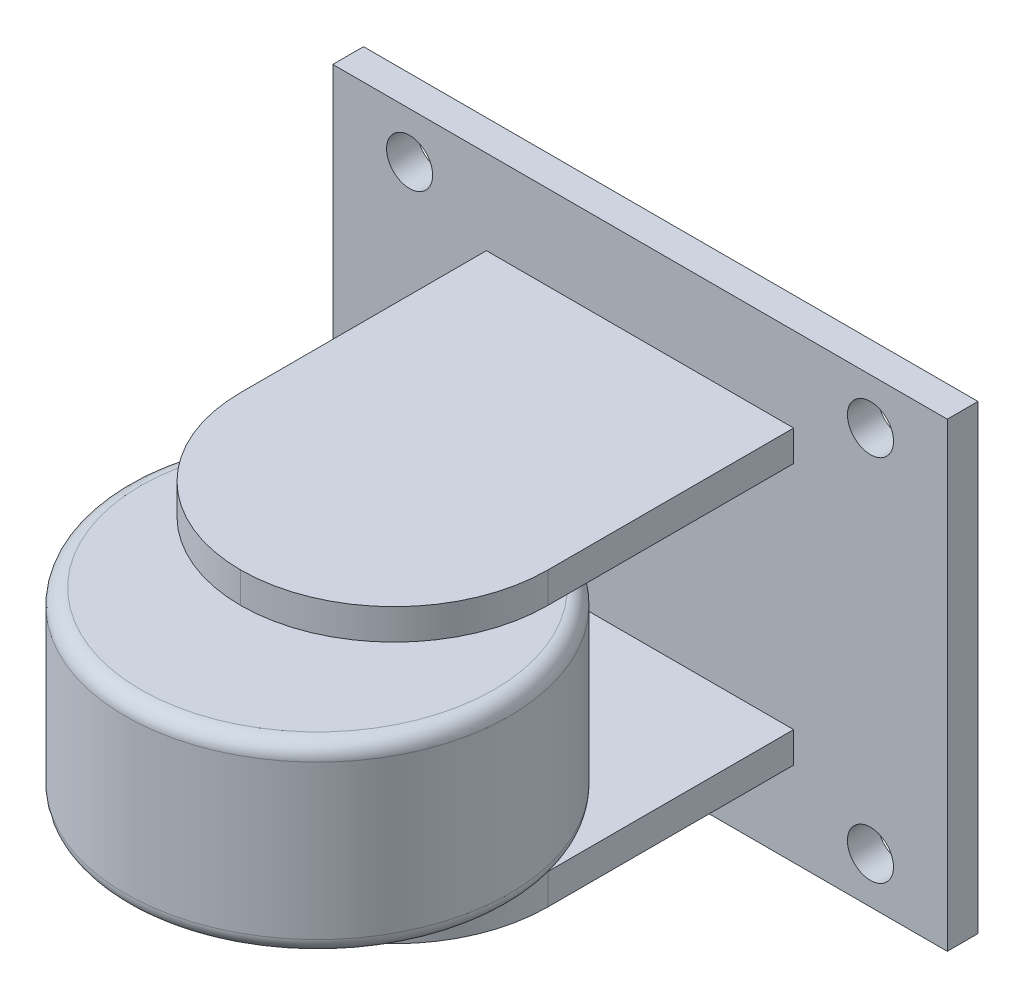
ISO-10303-21;
HEADER;
FILE_DESCRIPTION(('STEP AP214'),'2;1');
FILE_NAME('part.step','',(''),(''),'','','');
FILE_SCHEMA(('AUTOMOTIVE_DESIGN { 1 0 10303 214 1 1 1 1 }'));
ENDSEC;
DATA;
#1=APPLICATION_CONTEXT('core data for automotive mechanical design processes');
#2=APPLICATION_PROTOCOL_DEFINITION('international standard','automotive_design',2000,#1);
#3=PRODUCT_CONTEXT('',#1,'mechanical');
#4=PRODUCT('Part','Part','',(#3));
#5=PRODUCT_RELATED_PRODUCT_CATEGORY('part','',(#4));
#6=PRODUCT_DEFINITION_FORMATION('','',#4);
#7=PRODUCT_DEFINITION_CONTEXT('part definition',#1,'design');
#8=PRODUCT_DEFINITION('design','',#6,#7);
#9=PRODUCT_DEFINITION_SHAPE('','',#8);
#10=(LENGTH_UNIT() NAMED_UNIT(*) SI_UNIT(.MILLI.,.METRE.));
#11=(NAMED_UNIT(*) PLANE_ANGLE_UNIT() SI_UNIT($,.RADIAN.));
#12=(NAMED_UNIT(*) SI_UNIT($,.STERADIAN.) SOLID_ANGLE_UNIT());
#13=UNCERTAINTY_MEASURE_WITH_UNIT(LENGTH_MEASURE(1.E-05),#10,'distance_accuracy_value','');
#14=(GEOMETRIC_REPRESENTATION_CONTEXT(3) GLOBAL_UNCERTAINTY_ASSIGNED_CONTEXT((#13)) GLOBAL_UNIT_ASSIGNED_CONTEXT((#10,
#11,#12)) REPRESENTATION_CONTEXT('',''));
#15=CARTESIAN_POINT('',(0.,0.,0.));
#16=DIRECTION('',(0.,0.,1.));
#17=DIRECTION('',(1.,0.,0.));
#18=AXIS2_PLACEMENT_3D('',#15,#16,#17);
#19=CARTESIAN_POINT('',(0.,-16.5710678118655,23.));
#20=DIRECTION('',(0.,1.,0.));
#21=DIRECTION('',(0.,0.,1.));
#22=AXIS2_PLACEMENT_3D('',#19,#20,#21);
#23=CYLINDRICAL_SURFACE('',#22,2.5);
#24=CARTESIAN_POINT('',(0.,7.5,23.));
#25=DIRECTION('',(0.,1.,0.));
#26=DIRECTION('',(0.,0.,1.));
#27=AXIS2_PLACEMENT_3D('',#24,#25,#26);
#28=CIRCLE('',#27,2.5);
#29=CARTESIAN_POINT('',(0.,7.5,25.5));
#30=VERTEX_POINT('',#29);
#31=EDGE_CURVE('E242',#30,#30,#28,.T.);
#32=ORIENTED_EDGE('',*,*,#31,.F.);
#33=EDGE_LOOP('',(#32));
#34=FACE_BOUND('',#33,.T.);
#35=CARTESIAN_POINT('',(0.,6.,23.));
#36=DIRECTION('',(0.,-1.,0.));
#37=DIRECTION('',(0.,0.,-1.));
#38=AXIS2_PLACEMENT_3D('',#35,#36,#37);
#39=CIRCLE('',#38,2.5);
#40=CARTESIAN_POINT('',(0.,6.,20.5));
#41=VERTEX_POINT('',#40);
#42=EDGE_CURVE('E245',#41,#41,#39,.F.);
#43=ORIENTED_EDGE('',*,*,#42,.T.);
#44=EDGE_LOOP('',(#43));
#45=FACE_BOUND('',#44,.T.);
#46=ADVANCED_FACE('F36',(#34,#45),#23,.T.);
#47=CARTESIAN_POINT('',(0.,0.,2.));
#48=DIRECTION('',(0.,0.,-1.));
#49=DIRECTION('',(-1.,0.,0.));
#50=AXIS2_PLACEMENT_3D('',#47,#48,#49);
#51=PLANE('',#50);
#52=DIRECTION('',(0.,-1.,0.));
#53=VECTOR('',#52,1.);
#54=CARTESIAN_POINT('',(-10.,-7.5,2.));
#55=LINE('',#54,#53);
#56=CARTESIAN_POINT('',(-10.,-7.5,2.));
#57=VERTEX_POINT('',#56);
#58=CARTESIAN_POINT('',(-10.,-9.5,2.));
#59=VERTEX_POINT('',#58);
#60=EDGE_CURVE('E167',#57,#59,#55,.T.);
#61=ORIENTED_EDGE('',*,*,#60,.F.);
#62=DIRECTION('',(-1.,0.,0.));
#63=VECTOR('',#62,1.);
#64=CARTESIAN_POINT('',(-10.,-7.5,2.));
#65=LINE('',#64,#63);
#66=CARTESIAN_POINT('',(10.,-7.5,2.));
#67=VERTEX_POINT('',#66);
#68=EDGE_CURVE('E176',#67,#57,#65,.T.);
#69=ORIENTED_EDGE('',*,*,#68,.F.);
#70=DIRECTION('',(0.,1.,0.));
#71=VECTOR('',#70,1.);
#72=CARTESIAN_POINT('',(10.,-7.5,2.));
#73=LINE('',#72,#71);
#74=CARTESIAN_POINT('',(10.,-9.5,2.));
#75=VERTEX_POINT('',#74);
#76=EDGE_CURVE('E173',#75,#67,#73,.T.);
#77=ORIENTED_EDGE('',*,*,#76,.F.);
#78=DIRECTION('',(1.,0.,0.));
#79=VECTOR('',#78,1.);
#80=CARTESIAN_POINT('',(-10.,-9.5,2.));
#81=LINE('',#80,#79);
#82=EDGE_CURVE('E170',#59,#75,#81,.T.);
#83=ORIENTED_EDGE('',*,*,#82,.F.);
#84=EDGE_LOOP('',(#61,#69,#77,#83));
#85=FACE_BOUND('',#84,.T.);
#86=CARTESIAN_POINT('',(-15.,-12.,2.));
#87=DIRECTION('',(0.,0.,1.));
#88=DIRECTION('',(1.,0.,0.));
#89=AXIS2_PLACEMENT_3D('',#86,#87,#88);
#90=CIRCLE('',#89,1.5);
#91=CARTESIAN_POINT('',(-13.5,-12.,2.));
#92=VERTEX_POINT('',#91);
#93=EDGE_CURVE('E187',#92,#92,#90,.T.);
#94=ORIENTED_EDGE('',*,*,#93,.F.);
#95=EDGE_LOOP('',(#94));
#96=FACE_BOUND('',#95,.T.);
#97=CARTESIAN_POINT('',(15.,-12.,2.));
#98=DIRECTION('',(0.,0.,1.));
#99=DIRECTION('',(1.,0.,0.));
#100=AXIS2_PLACEMENT_3D('',#97,#98,#99);
#101=CIRCLE('',#100,1.5);
#102=CARTESIAN_POINT('',(16.5,-12.,2.));
#103=VERTEX_POINT('',#102);
#104=EDGE_CURVE('E198',#103,#103,#101,.T.);
#105=ORIENTED_EDGE('',*,*,#104,.F.);
#106=EDGE_LOOP('',(#105));
#107=FACE_BOUND('',#106,.T.);
#108=CARTESIAN_POINT('',(15.,12.,2.));
#109=DIRECTION('',(0.,0.,1.));
#110=DIRECTION('',(1.,0.,0.));
#111=AXIS2_PLACEMENT_3D('',#108,#109,#110);
#112=CIRCLE('',#111,1.5);
#113=CARTESIAN_POINT('',(16.5,12.,2.));
#114=VERTEX_POINT('',#113);
#115=EDGE_CURVE('E192',#114,#114,#112,.T.);
#116=ORIENTED_EDGE('',*,*,#115,.F.);
#117=EDGE_LOOP('',(#116));
#118=FACE_BOUND('',#117,.T.);
#119=CARTESIAN_POINT('',(-15.,12.,2.));
#120=DIRECTION('',(0.,0.,1.));
#121=DIRECTION('',(1.,0.,0.));
#122=AXIS2_PLACEMENT_3D('',#119,#120,#121);
#123=CIRCLE('',#122,1.5);
#124=CARTESIAN_POINT('',(-13.5,12.,2.));
#125=VERTEX_POINT('',#124);
#126=EDGE_CURVE('E191',#125,#125,#123,.T.);
#127=ORIENTED_EDGE('',*,*,#126,.F.);
#128=EDGE_LOOP('',(#127));
#129=FACE_BOUND('',#128,.T.);
#130=DIRECTION('',(0.,1.,0.));
#131=VECTOR('',#130,1.);
#132=CARTESIAN_POINT('',(20.,-15.,2.));
#133=LINE('',#132,#131);
#134=CARTESIAN_POINT('',(20.,-15.,2.));
#135=VERTEX_POINT('',#134);
#136=CARTESIAN_POINT('',(20.,15.,2.));
#137=VERTEX_POINT('',#136);
#138=EDGE_CURVE('E212',#135,#137,#133,.T.);
#139=ORIENTED_EDGE('',*,*,#138,.T.);
#140=DIRECTION('',(-1.,0.,0.));
#141=VECTOR('',#140,1.);
#142=CARTESIAN_POINT('',(-20.,15.,2.));
#143=LINE('',#142,#141);
#144=CARTESIAN_POINT('',(-20.,15.,2.));
#145=VERTEX_POINT('',#144);
#146=EDGE_CURVE('E215',#137,#145,#143,.T.);
#147=ORIENTED_EDGE('',*,*,#146,.T.);
#148=DIRECTION('',(0.,-1.,0.));
#149=VECTOR('',#148,1.);
#150=CARTESIAN_POINT('',(-20.,-15.,2.));
#151=LINE('',#150,#149);
#152=CARTESIAN_POINT('',(-20.,-15.,2.));
#153=VERTEX_POINT('',#152);
#154=EDGE_CURVE('E218',#145,#153,#151,.T.);
#155=ORIENTED_EDGE('',*,*,#154,.T.);
#156=DIRECTION('',(1.,0.,0.));
#157=VECTOR('',#156,1.);
#158=CARTESIAN_POINT('',(-20.,-15.,2.));
#159=LINE('',#158,#157);
#160=EDGE_CURVE('E220',#153,#135,#159,.T.);
#161=ORIENTED_EDGE('',*,*,#160,.T.);
#162=EDGE_LOOP('',(#139,#147,#155,#161));
#163=FACE_BOUND('',#162,.T.);
#164=DIRECTION('',(0.,1.,0.));
#165=VECTOR('',#164,1.);
#166=CARTESIAN_POINT('',(10.,7.5,2.));
#167=LINE('',#166,#165);
#168=CARTESIAN_POINT('',(10.,7.5,2.));
#169=VERTEX_POINT('',#168);
#170=CARTESIAN_POINT('',(10.,9.5,2.));
#171=VERTEX_POINT('',#170);
#172=EDGE_CURVE('E139',#169,#171,#167,.T.);
#173=ORIENTED_EDGE('',*,*,#172,.F.);
#174=DIRECTION('',(1.,0.,0.));
#175=VECTOR('',#174,1.);
#176=CARTESIAN_POINT('',(10.,7.5,2.));
#177=LINE('',#176,#175);
#178=CARTESIAN_POINT('',(-10.,7.5,2.));
#179=VERTEX_POINT('',#178);
#180=EDGE_CURVE('E144',#179,#169,#177,.T.);
#181=ORIENTED_EDGE('',*,*,#180,.F.);
#182=DIRECTION('',(0.,-1.,0.));
#183=VECTOR('',#182,1.);
#184=CARTESIAN_POINT('',(-10.,7.5,2.));
#185=LINE('',#184,#183);
#186=CARTESIAN_POINT('',(-10.,9.5,2.));
#187=VERTEX_POINT('',#186);
#188=EDGE_CURVE('E157',#187,#179,#185,.T.);
#189=ORIENTED_EDGE('',*,*,#188,.F.);
#190=DIRECTION('',(-1.,0.,0.));
#191=VECTOR('',#190,1.);
#192=CARTESIAN_POINT('',(10.,9.5,2.));
#193=LINE('',#192,#191);
#194=EDGE_CURVE('E153',#171,#187,#193,.T.);
#195=ORIENTED_EDGE('',*,*,#194,.F.);
#196=EDGE_LOOP('',(#173,#181,#189,#195));
#197=FACE_BOUND('',#196,.T.);
#198=ADVANCED_FACE('F149',(#85,#96,#107,#118,#129,#163,#197),#51,.F.);
#199=CARTESIAN_POINT('',(20.,-15.,2.));
#200=DIRECTION('',(-1.,0.,0.));
#201=DIRECTION('',(0.,0.,1.));
#202=AXIS2_PLACEMENT_3D('',#199,#200,#201);
#203=PLANE('',#202);
#204=DIRECTION('',(0.,1.,0.));
#205=VECTOR('',#204,1.);
#206=CARTESIAN_POINT('',(20.,-15.,0.));
#207=LINE('',#206,#205);
#208=CARTESIAN_POINT('',(20.,-15.,0.));
#209=VERTEX_POINT('',#208);
#210=CARTESIAN_POINT('',(20.,15.,0.));
#211=VERTEX_POINT('',#210);
#212=EDGE_CURVE('E209',#209,#211,#207,.T.);
#213=ORIENTED_EDGE('',*,*,#212,.T.);
#214=DIRECTION('',(0.,0.,-1.));
#215=VECTOR('',#214,1.);
#216=CARTESIAN_POINT('',(20.,15.,2.));
#217=LINE('',#216,#215);
#218=EDGE_CURVE('E238',#137,#211,#217,.T.);
#219=ORIENTED_EDGE('',*,*,#218,.F.);
#220=ORIENTED_EDGE('',*,*,#138,.F.);
#221=DIRECTION('',(0.,0.,-1.));
#222=VECTOR('',#221,1.);
#223=CARTESIAN_POINT('',(20.,-15.,2.));
#224=LINE('',#223,#222);
#225=EDGE_CURVE('E222',#135,#209,#224,.T.);
#226=ORIENTED_EDGE('',*,*,#225,.T.);
#227=EDGE_LOOP('',(#213,#219,#220,#226));
#228=FACE_BOUND('',#227,.T.);
#229=ADVANCED_FACE('F336',(#228),#203,.F.);
#230=CARTESIAN_POINT('',(-20.,15.,2.));
#231=DIRECTION('',(0.,-1.,0.));
#232=DIRECTION('',(0.,0.,-1.));
#233=AXIS2_PLACEMENT_3D('',#230,#231,#232);
#234=PLANE('',#233);
#235=DIRECTION('',(-1.,0.,0.));
#236=VECTOR('',#235,1.);
#237=CARTESIAN_POINT('',(-20.,15.,0.));
#238=LINE('',#237,#236);
#239=CARTESIAN_POINT('',(-20.,15.,0.));
#240=VERTEX_POINT('',#239);
#241=EDGE_CURVE('E225',#211,#240,#238,.T.);
#242=ORIENTED_EDGE('',*,*,#241,.T.);
#243=DIRECTION('',(0.,0.,-1.));
#244=VECTOR('',#243,1.);
#245=CARTESIAN_POINT('',(-20.,15.,2.));
#246=LINE('',#245,#244);
#247=EDGE_CURVE('E235',#145,#240,#246,.T.);
#248=ORIENTED_EDGE('',*,*,#247,.F.);
#249=ORIENTED_EDGE('',*,*,#146,.F.);
#250=ORIENTED_EDGE('',*,*,#218,.T.);
#251=EDGE_LOOP('',(#242,#248,#249,#250));
#252=FACE_BOUND('',#251,.T.);
#253=ADVANCED_FACE('F542',(#252),#234,.F.);
#254=CARTESIAN_POINT('',(-20.,-15.,2.));
#255=DIRECTION('',(1.,0.,0.));
#256=DIRECTION('',(0.,0.,-1.));
#257=AXIS2_PLACEMENT_3D('',#254,#255,#256);
#258=PLANE('',#257);
#259=DIRECTION('',(0.,-1.,0.));
#260=VECTOR('',#259,1.);
#261=CARTESIAN_POINT('',(-20.,-15.,0.));
#262=LINE('',#261,#260);
#263=CARTESIAN_POINT('',(-20.,-15.,0.));
#264=VERTEX_POINT('',#263);
#265=EDGE_CURVE('E227',#240,#264,#262,.T.);
#266=ORIENTED_EDGE('',*,*,#265,.T.);
#267=DIRECTION('',(0.,0.,-1.));
#268=VECTOR('',#267,1.);
#269=CARTESIAN_POINT('',(-20.,-15.,2.));
#270=LINE('',#269,#268);
#271=EDGE_CURVE('E232',#153,#264,#270,.T.);
#272=ORIENTED_EDGE('',*,*,#271,.F.);
#273=ORIENTED_EDGE('',*,*,#154,.F.);
#274=ORIENTED_EDGE('',*,*,#247,.T.);
#275=EDGE_LOOP('',(#266,#272,#273,#274));
#276=FACE_BOUND('',#275,.T.);
#277=ADVANCED_FACE('F532',(#276),#258,.F.);
#278=CARTESIAN_POINT('',(-20.,-15.,2.));
#279=DIRECTION('',(0.,1.,0.));
#280=DIRECTION('',(0.,0.,1.));
#281=AXIS2_PLACEMENT_3D('',#278,#279,#280);
#282=PLANE('',#281);
#283=DIRECTION('',(1.,0.,0.));
#284=VECTOR('',#283,1.);
#285=CARTESIAN_POINT('',(-20.,-15.,0.));
#286=LINE('',#285,#284);
#287=EDGE_CURVE('E216',#264,#209,#286,.T.);
#288=ORIENTED_EDGE('',*,*,#287,.T.);
#289=ORIENTED_EDGE('',*,*,#225,.F.);
#290=ORIENTED_EDGE('',*,*,#160,.F.);
#291=ORIENTED_EDGE('',*,*,#271,.T.);
#292=EDGE_LOOP('',(#288,#289,#290,#291));
#293=FACE_BOUND('',#292,.T.);
#294=ADVANCED_FACE('F522',(#293),#282,.F.);
#295=CARTESIAN_POINT('',(0.,0.,0.));
#296=DIRECTION('',(0.,0.,-1.));
#297=DIRECTION('',(-1.,0.,0.));
#298=AXIS2_PLACEMENT_3D('',#295,#296,#297);
#299=PLANE('',#298);
#300=CARTESIAN_POINT('',(-15.,-12.,0.));
#301=DIRECTION('',(0.,0.,1.));
#302=DIRECTION('',(1.,0.,0.));
#303=AXIS2_PLACEMENT_3D('',#300,#301,#302);
#304=CIRCLE('',#303,1.5);
#305=CARTESIAN_POINT('',(-13.5,-12.,0.));
#306=VERTEX_POINT('',#305);
#307=EDGE_CURVE('E201',#306,#306,#304,.T.);
#308=ORIENTED_EDGE('',*,*,#307,.T.);
#309=EDGE_LOOP('',(#308));
#310=FACE_BOUND('',#309,.T.);
#311=CARTESIAN_POINT('',(15.,-12.,0.));
#312=DIRECTION('',(0.,0.,1.));
#313=DIRECTION('',(1.,0.,0.));
#314=AXIS2_PLACEMENT_3D('',#311,#312,#313);
#315=CIRCLE('',#314,1.5);
#316=CARTESIAN_POINT('',(16.5,-12.,0.));
#317=VERTEX_POINT('',#316);
#318=EDGE_CURVE('E195',#317,#317,#315,.T.);
#319=ORIENTED_EDGE('',*,*,#318,.T.);
#320=EDGE_LOOP('',(#319));
#321=FACE_BOUND('',#320,.T.);
#322=CARTESIAN_POINT('',(15.,12.,0.));
#323=DIRECTION('',(0.,0.,1.));
#324=DIRECTION('',(1.,0.,0.));
#325=AXIS2_PLACEMENT_3D('',#322,#323,#324);
#326=CIRCLE('',#325,1.5);
#327=CARTESIAN_POINT('',(16.5,12.,0.));
#328=VERTEX_POINT('',#327);
#329=EDGE_CURVE('E188',#328,#328,#326,.T.);
#330=ORIENTED_EDGE('',*,*,#329,.T.);
#331=EDGE_LOOP('',(#330));
#332=FACE_BOUND('',#331,.T.);
#333=CARTESIAN_POINT('',(-15.,12.,0.));
#334=DIRECTION('',(0.,0.,1.));
#335=DIRECTION('',(1.,0.,0.));
#336=AXIS2_PLACEMENT_3D('',#333,#334,#335);
#337=CIRCLE('',#336,1.5);
#338=CARTESIAN_POINT('',(-13.5,12.,0.));
#339=VERTEX_POINT('',#338);
#340=EDGE_CURVE('E206',#339,#339,#337,.T.);
#341=ORIENTED_EDGE('',*,*,#340,.T.);
#342=EDGE_LOOP('',(#341));
#343=FACE_BOUND('',#342,.T.);
#344=ORIENTED_EDGE('',*,*,#212,.F.);
#345=ORIENTED_EDGE('',*,*,#287,.F.);
#346=ORIENTED_EDGE('',*,*,#265,.F.);
#347=ORIENTED_EDGE('',*,*,#241,.F.);
#348=EDGE_LOOP('',(#344,#345,#346,#347));
#349=FACE_BOUND('',#348,.T.);
#350=ADVANCED_FACE('F512',(#310,#321,#332,#343,#349),#299,.T.);
#351=CARTESIAN_POINT('',(-15.,12.,0.));
#352=DIRECTION('',(0.,0.,1.));
#353=DIRECTION('',(1.,0.,0.));
#354=AXIS2_PLACEMENT_3D('',#351,#352,#353);
#355=CYLINDRICAL_SURFACE('',#354,1.5);
#356=ORIENTED_EDGE('',*,*,#340,.F.);
#357=EDGE_LOOP('',(#356));
#358=FACE_BOUND('',#357,.T.);
#359=ORIENTED_EDGE('',*,*,#126,.T.);
#360=EDGE_LOOP('',(#359));
#361=FACE_BOUND('',#360,.T.);
#362=ADVANCED_FACE('F502',(#358,#361),#355,.F.);
#363=CARTESIAN_POINT('',(15.,12.,0.));
#364=DIRECTION('',(0.,0.,1.));
#365=DIRECTION('',(1.,0.,0.));
#366=AXIS2_PLACEMENT_3D('',#363,#364,#365);
#367=CYLINDRICAL_SURFACE('',#366,1.5);
#368=ORIENTED_EDGE('',*,*,#329,.F.);
#369=EDGE_LOOP('',(#368));
#370=FACE_BOUND('',#369,.T.);
#371=ORIENTED_EDGE('',*,*,#115,.T.);
#372=EDGE_LOOP('',(#371));
#373=FACE_BOUND('',#372,.T.);
#374=ADVANCED_FACE('F492',(#370,#373),#367,.F.);
#375=CARTESIAN_POINT('',(15.,-12.,0.));
#376=DIRECTION('',(0.,0.,1.));
#377=DIRECTION('',(1.,0.,0.));
#378=AXIS2_PLACEMENT_3D('',#375,#376,#377);
#379=CYLINDRICAL_SURFACE('',#378,1.5);
#380=ORIENTED_EDGE('',*,*,#318,.F.);
#381=EDGE_LOOP('',(#380));
#382=FACE_BOUND('',#381,.T.);
#383=ORIENTED_EDGE('',*,*,#104,.T.);
#384=EDGE_LOOP('',(#383));
#385=FACE_BOUND('',#384,.T.);
#386=ADVANCED_FACE('F482',(#382,#385),#379,.F.);
#387=CARTESIAN_POINT('',(-15.,-12.,0.));
#388=DIRECTION('',(0.,0.,1.));
#389=DIRECTION('',(1.,0.,0.));
#390=AXIS2_PLACEMENT_3D('',#387,#388,#389);
#391=CYLINDRICAL_SURFACE('',#390,1.5);
#392=ORIENTED_EDGE('',*,*,#307,.F.);
#393=EDGE_LOOP('',(#392));
#394=FACE_BOUND('',#393,.T.);
#395=ORIENTED_EDGE('',*,*,#93,.T.);
#396=EDGE_LOOP('',(#395));
#397=FACE_BOUND('',#396,.T.);
#398=ADVANCED_FACE('F455',(#394,#397),#391,.F.);
#399=CARTESIAN_POINT('',(-10.,-7.5,28.));
#400=DIRECTION('',(1.,0.,0.));
#401=DIRECTION('',(0.,0.,-1.));
#402=AXIS2_PLACEMENT_3D('',#399,#400,#401);
#403=PLANE('',#402);
#404=DIRECTION('',(0.,0.,-1.));
#405=VECTOR('',#404,1.);
#406=CARTESIAN_POINT('',(-10.,-9.5,28.));
#407=LINE('',#406,#405);
#408=CARTESIAN_POINT('',(-10.,-9.5,18.));
#409=VERTEX_POINT('',#408);
#410=EDGE_CURVE('E185',#409,#59,#407,.T.);
#411=ORIENTED_EDGE('',*,*,#410,.F.);
#412=DIRECTION('',(0.,-1.,0.));
#413=VECTOR('',#412,1.);
#414=CARTESIAN_POINT('',(-9.99999999999999,-7.5,18.));
#415=LINE('',#414,#413);
#416=CARTESIAN_POINT('',(-10.,-7.5,18.));
#417=VERTEX_POINT('',#416);
#418=EDGE_CURVE('E262',#409,#417,#415,.F.);
#419=ORIENTED_EDGE('',*,*,#418,.T.);
#420=DIRECTION('',(0.,0.,-1.));
#421=VECTOR('',#420,1.);
#422=CARTESIAN_POINT('',(-10.,-7.5,28.));
#423=LINE('',#422,#421);
#424=EDGE_CURVE('E179',#417,#57,#423,.T.);
#425=ORIENTED_EDGE('',*,*,#424,.T.);
#426=ORIENTED_EDGE('',*,*,#60,.T.);
#427=EDGE_LOOP('',(#411,#419,#425,#426));
#428=FACE_BOUND('',#427,.T.);
#429=ADVANCED_FACE('F445',(#428),#403,.F.);
#430=CARTESIAN_POINT('',(-10.,-9.5,28.));
#431=DIRECTION('',(0.,1.,0.));
#432=DIRECTION('',(0.,0.,1.));
#433=AXIS2_PLACEMENT_3D('',#430,#431,#432);
#434=PLANE('',#433);
#435=DIRECTION('',(0.,0.,-1.));
#436=VECTOR('',#435,1.);
#437=CARTESIAN_POINT('',(10.,-9.5,28.));
#438=LINE('',#437,#436);
#439=CARTESIAN_POINT('',(10.,-9.5,18.));
#440=VERTEX_POINT('',#439);
#441=EDGE_CURVE('E183',#440,#75,#438,.T.);
#442=ORIENTED_EDGE('',*,*,#441,.F.);
#443=CARTESIAN_POINT('',(0.,-9.5,18.));
#444=DIRECTION('',(0.,1.,0.));
#445=DIRECTION('',(0.,0.,1.));
#446=AXIS2_PLACEMENT_3D('',#443,#444,#445);
#447=CIRCLE('',#446,10.);
#448=CARTESIAN_POINT('',(0.,-9.5,28.));
#449=VERTEX_POINT('',#448);
#450=EDGE_CURVE('E260',#440,#449,#447,.F.);
#451=ORIENTED_EDGE('',*,*,#450,.T.);
#452=CARTESIAN_POINT('',(0.,-9.5,18.));
#453=DIRECTION('',(0.,1.,0.));
#454=DIRECTION('',(0.,0.,1.));
#455=AXIS2_PLACEMENT_3D('',#452,#453,#454);
#456=CIRCLE('',#455,10.);
#457=EDGE_CURVE('E258',#449,#409,#456,.F.);
#458=ORIENTED_EDGE('',*,*,#457,.T.);
#459=ORIENTED_EDGE('',*,*,#410,.T.);
#460=ORIENTED_EDGE('',*,*,#82,.T.);
#461=EDGE_LOOP('',(#442,#451,#458,#459,#460));
#462=FACE_BOUND('',#461,.T.);
#463=ADVANCED_FACE('F435',(#462),#434,.F.);
#464=CARTESIAN_POINT('',(10.,-7.5,28.));
#465=DIRECTION('',(-1.,0.,0.));
#466=DIRECTION('',(0.,0.,1.));
#467=AXIS2_PLACEMENT_3D('',#464,#465,#466);
#468=PLANE('',#467);
#469=DIRECTION('',(0.,0.,-1.));
#470=VECTOR('',#469,1.);
#471=CARTESIAN_POINT('',(10.,-7.5,28.));
#472=LINE('',#471,#470);
#473=CARTESIAN_POINT('',(10.,-7.5,18.));
#474=VERTEX_POINT('',#473);
#475=EDGE_CURVE('E181',#474,#67,#472,.T.);
#476=ORIENTED_EDGE('',*,*,#475,.F.);
#477=DIRECTION('',(0.,1.,0.));
#478=VECTOR('',#477,1.);
#479=CARTESIAN_POINT('',(10.,-9.5,18.));
#480=LINE('',#479,#478);
#481=EDGE_CURVE('E255',#474,#440,#480,.F.);
#482=ORIENTED_EDGE('',*,*,#481,.T.);
#483=ORIENTED_EDGE('',*,*,#441,.T.);
#484=ORIENTED_EDGE('',*,*,#76,.T.);
#485=EDGE_LOOP('',(#476,#482,#483,#484));
#486=FACE_BOUND('',#485,.T.);
#487=ADVANCED_FACE('F426',(#486),#468,.F.);
#488=CARTESIAN_POINT('',(-10.,-7.5,28.));
#489=DIRECTION('',(0.,-1.,0.));
#490=DIRECTION('',(0.,0.,-1.));
#491=AXIS2_PLACEMENT_3D('',#488,#489,#490);
#492=PLANE('',#491);
#493=CARTESIAN_POINT('',(0.,-7.5,23.));
#494=DIRECTION('',(0.,-1.,0.));
#495=DIRECTION('',(0.,0.,-1.));
#496=AXIS2_PLACEMENT_3D('',#493,#494,#495);
#497=CIRCLE('',#496,2.5);
#498=CARTESIAN_POINT('',(0.,-7.5,20.5));
#499=VERTEX_POINT('',#498);
#500=EDGE_CURVE('E154',#499,#499,#497,.T.);
#501=ORIENTED_EDGE('',*,*,#500,.T.);
#502=EDGE_LOOP('',(#501));
#503=FACE_BOUND('',#502,.T.);
#504=CARTESIAN_POINT('',(0.,-7.5,18.));
#505=DIRECTION('',(0.,-1.,0.));
#506=DIRECTION('',(0.,0.,-1.));
#507=AXIS2_PLACEMENT_3D('',#504,#505,#506);
#508=CIRCLE('',#507,10.);
#509=CARTESIAN_POINT('',(0.,-7.5,28.));
#510=VERTEX_POINT('',#509);
#511=EDGE_CURVE('E251',#417,#510,#508,.F.);
#512=ORIENTED_EDGE('',*,*,#511,.T.);
#513=CARTESIAN_POINT('',(0.,-7.5,18.));
#514=DIRECTION('',(0.,-1.,0.));
#515=DIRECTION('',(0.,0.,-1.));
#516=AXIS2_PLACEMENT_3D('',#513,#514,#515);
#517=CIRCLE('',#516,10.);
#518=EDGE_CURVE('E253',#510,#474,#517,.F.);
#519=ORIENTED_EDGE('',*,*,#518,.T.);
#520=ORIENTED_EDGE('',*,*,#475,.T.);
#521=ORIENTED_EDGE('',*,*,#68,.T.);
#522=ORIENTED_EDGE('',*,*,#424,.F.);
#523=EDGE_LOOP('',(#512,#519,#520,#521,#522));
#524=FACE_BOUND('',#523,.T.);
#525=ADVANCED_FACE('F417',(#503,#524),#492,.F.);
#526=CARTESIAN_POINT('',(10.,7.5,28.));
#527=DIRECTION('',(-1.,0.,0.));
#528=DIRECTION('',(0.,0.,1.));
#529=AXIS2_PLACEMENT_3D('',#526,#527,#528);
#530=PLANE('',#529);
#531=DIRECTION('',(0.,0.,-1.));
#532=VECTOR('',#531,1.);
#533=CARTESIAN_POINT('',(10.,9.5,28.));
#534=LINE('',#533,#532);
#535=CARTESIAN_POINT('',(10.,9.5,18.));
#536=VERTEX_POINT('',#535);
#537=EDGE_CURVE('E165',#536,#171,#534,.T.);
#538=ORIENTED_EDGE('',*,*,#537,.F.);
#539=DIRECTION('',(0.,1.,0.));
#540=VECTOR('',#539,1.);
#541=CARTESIAN_POINT('',(10.,7.5,18.));
#542=LINE('',#541,#540);
#543=CARTESIAN_POINT('',(10.,7.5,18.));
#544=VERTEX_POINT('',#543);
#545=EDGE_CURVE('E141',#536,#544,#542,.F.);
#546=ORIENTED_EDGE('',*,*,#545,.T.);
#547=DIRECTION('',(0.,0.,-1.));
#548=VECTOR('',#547,1.);
#549=CARTESIAN_POINT('',(10.,7.5,28.));
#550=LINE('',#549,#548);
#551=EDGE_CURVE('E135',#544,#169,#550,.T.);
#552=ORIENTED_EDGE('',*,*,#551,.T.);
#553=ORIENTED_EDGE('',*,*,#172,.T.);
#554=EDGE_LOOP('',(#538,#546,#552,#553));
#555=FACE_BOUND('',#554,.T.);
#556=ADVANCED_FACE('F138',(#555),#530,.F.);
#557=CARTESIAN_POINT('',(10.,9.5,28.));
#558=DIRECTION('',(0.,-1.,0.));
#559=DIRECTION('',(0.,0.,-1.));
#560=AXIS2_PLACEMENT_3D('',#557,#558,#559);
#561=PLANE('',#560);
#562=CARTESIAN_POINT('',(0.,9.5,18.));
#563=DIRECTION('',(0.,-1.,0.));
#564=DIRECTION('',(0.,0.,-1.));
#565=AXIS2_PLACEMENT_3D('',#562,#563,#564);
#566=CIRCLE('',#565,10.);
#567=CARTESIAN_POINT('',(-10.,9.5,18.));
#568=VERTEX_POINT('',#567);
#569=CARTESIAN_POINT('',(0.,9.5,28.));
#570=VERTEX_POINT('',#569);
#571=EDGE_CURVE('E264',#568,#570,#566,.F.);
#572=ORIENTED_EDGE('',*,*,#571,.T.);
#573=CARTESIAN_POINT('',(0.,9.5,18.));
#574=DIRECTION('',(0.,-1.,0.));
#575=DIRECTION('',(0.,0.,-1.));
#576=AXIS2_PLACEMENT_3D('',#573,#574,#575);
#577=CIRCLE('',#576,10.);
#578=EDGE_CURVE('E266',#570,#536,#577,.F.);
#579=ORIENTED_EDGE('',*,*,#578,.T.);
#580=ORIENTED_EDGE('',*,*,#537,.T.);
#581=ORIENTED_EDGE('',*,*,#194,.T.);
#582=DIRECTION('',(0.,0.,-1.));
#583=VECTOR('',#582,1.);
#584=CARTESIAN_POINT('',(-10.,9.5,28.));
#585=LINE('',#584,#583);
#586=EDGE_CURVE('E163',#568,#187,#585,.T.);
#587=ORIENTED_EDGE('',*,*,#586,.F.);
#588=EDGE_LOOP('',(#572,#579,#580,#581,#587));
#589=FACE_BOUND('',#588,.T.);
#590=ADVANCED_FACE('F312',(#589),#561,.F.);
#591=CARTESIAN_POINT('',(-10.,7.5,28.));
#592=DIRECTION('',(1.,0.,0.));
#593=DIRECTION('',(0.,0.,-1.));
#594=AXIS2_PLACEMENT_3D('',#591,#592,#593);
#595=PLANE('',#594);
#596=DIRECTION('',(0.,0.,-1.));
#597=VECTOR('',#596,1.);
#598=CARTESIAN_POINT('',(-10.,7.5,28.));
#599=LINE('',#598,#597);
#600=CARTESIAN_POINT('',(-10.,7.5,18.));
#601=VERTEX_POINT('',#600);
#602=EDGE_CURVE('E143',#601,#179,#599,.T.);
#603=ORIENTED_EDGE('',*,*,#602,.F.);
#604=DIRECTION('',(0.,-1.,0.));
#605=VECTOR('',#604,1.);
#606=CARTESIAN_POINT('',(-10.,9.5,18.));
#607=LINE('',#606,#605);
#608=EDGE_CURVE('E271',#601,#568,#607,.F.);
#609=ORIENTED_EDGE('',*,*,#608,.T.);
#610=ORIENTED_EDGE('',*,*,#586,.T.);
#611=ORIENTED_EDGE('',*,*,#188,.T.);
#612=EDGE_LOOP('',(#603,#609,#610,#611));
#613=FACE_BOUND('',#612,.T.);
#614=ADVANCED_FACE('F321',(#613),#595,.F.);
#615=CARTESIAN_POINT('',(10.,7.5,28.));
#616=DIRECTION('',(0.,1.,0.));
#617=DIRECTION('',(0.,0.,1.));
#618=AXIS2_PLACEMENT_3D('',#615,#616,#617);
#619=PLANE('',#618);
#620=ORIENTED_EDGE('',*,*,#31,.T.);
#621=EDGE_LOOP('',(#620));
#622=FACE_BOUND('',#621,.T.);
#623=ORIENTED_EDGE('',*,*,#551,.F.);
#624=CARTESIAN_POINT('',(0.,7.5,18.));
#625=DIRECTION('',(0.,1.,0.));
#626=DIRECTION('',(0.,0.,1.));
#627=AXIS2_PLACEMENT_3D('',#624,#625,#626);
#628=CIRCLE('',#627,10.);
#629=CARTESIAN_POINT('',(0.,7.5,28.));
#630=VERTEX_POINT('',#629);
#631=EDGE_CURVE('E56',#544,#630,#628,.F.);
#632=ORIENTED_EDGE('',*,*,#631,.T.);
#633=CARTESIAN_POINT('',(0.,7.5,18.));
#634=DIRECTION('',(0.,1.,0.));
#635=DIRECTION('',(0.,0.,1.));
#636=AXIS2_PLACEMENT_3D('',#633,#634,#635);
#637=CIRCLE('',#636,10.);
#638=EDGE_CURVE('E51',#630,#601,#637,.F.);
#639=ORIENTED_EDGE('',*,*,#638,.T.);
#640=ORIENTED_EDGE('',*,*,#602,.T.);
#641=ORIENTED_EDGE('',*,*,#180,.T.);
#642=EDGE_LOOP('',(#623,#632,#639,#640,#641));
#643=FACE_BOUND('',#642,.T.);
#644=ADVANCED_FACE('F156',(#622,#643),#619,.F.);
#645=CARTESIAN_POINT('',(0.,-6.,23.));
#646=DIRECTION('',(0.,-1.,0.));
#647=DIRECTION('',(0.,0.,-1.));
#648=AXIS2_PLACEMENT_3D('',#645,#646,#647);
#649=CIRCLE('',#648,2.5);
#650=CARTESIAN_POINT('',(0.,-6.,20.5));
#651=VERTEX_POINT('',#650);
#652=EDGE_CURVE('E241',#651,#651,#649,.F.);
#653=ORIENTED_EDGE('',*,*,#652,.F.);
#654=EDGE_LOOP('',(#653));
#655=FACE_BOUND('',#654,.T.);
#656=ORIENTED_EDGE('',*,*,#500,.F.);
#657=EDGE_LOOP('',(#656));
#658=FACE_BOUND('',#657,.T.);
#659=ADVANCED_FACE('F302',(#655,#658),#23,.T.);
#660=CARTESIAN_POINT('',(0.,-6.,23.));
#661=DIRECTION('',(0.,1.,0.));
#662=DIRECTION('',(0.,0.,1.));
#663=AXIS2_PLACEMENT_3D('',#660,#661,#662);
#664=CYLINDRICAL_SURFACE('',#663,12.5);
#665=CARTESIAN_POINT('',(0.,-5.,23.));
#666=DIRECTION('',(0.,-1.,0.));
#667=DIRECTION('',(0.,0.,-1.));
#668=AXIS2_PLACEMENT_3D('',#665,#666,#667);
#669=CIRCLE('',#668,12.5);
#670=CARTESIAN_POINT('',(0.,-5.,10.5));
#671=VERTEX_POINT('',#670);
#672=EDGE_CURVE('E44',#671,#671,#669,.F.);
#673=ORIENTED_EDGE('',*,*,#672,.T.);
#674=EDGE_LOOP('',(#673));
#675=FACE_BOUND('',#674,.T.);
#676=CARTESIAN_POINT('',(0.,5.,23.));
#677=DIRECTION('',(0.,-1.,0.));
#678=DIRECTION('',(0.,0.,-1.));
#679=AXIS2_PLACEMENT_3D('',#676,#677,#678);
#680=CIRCLE('',#679,12.5);
#681=CARTESIAN_POINT('',(0.,5.,10.5));
#682=VERTEX_POINT('',#681);
#683=EDGE_CURVE('E281',#682,#682,#680,.T.);
#684=ORIENTED_EDGE('',*,*,#683,.T.);
#685=EDGE_LOOP('',(#684));
#686=FACE_BOUND('',#685,.T.);
#687=ADVANCED_FACE('F286',(#675,#686),#664,.T.);
#688=CARTESIAN_POINT('',(0.,-6.,23.));
#689=DIRECTION('',(0.,-1.,0.));
#690=DIRECTION('',(0.,0.,-1.));
#691=AXIS2_PLACEMENT_3D('',#688,#689,#690);
#692=PLANE('',#691);
#693=CARTESIAN_POINT('',(0.,-6.,23.));
#694=DIRECTION('',(0.,-1.,0.));
#695=DIRECTION('',(0.,0.,-1.));
#696=AXIS2_PLACEMENT_3D('',#693,#694,#695);
#697=CIRCLE('',#696,11.5);
#698=CARTESIAN_POINT('',(0.,-6.,11.5));
#699=VERTEX_POINT('',#698);
#700=EDGE_CURVE('E273',#699,#699,#697,.T.);
#701=ORIENTED_EDGE('',*,*,#700,.T.);
#702=EDGE_LOOP('',(#701));
#703=FACE_BOUND('',#702,.T.);
#704=ORIENTED_EDGE('',*,*,#652,.T.);
#705=EDGE_LOOP('',(#704));
#706=FACE_BOUND('',#705,.T.);
#707=ADVANCED_FACE('F295',(#703,#706),#692,.T.);
#708=CARTESIAN_POINT('',(0.,6.,23.));
#709=DIRECTION('',(0.,-1.,0.));
#710=DIRECTION('',(0.,0.,-1.));
#711=AXIS2_PLACEMENT_3D('',#708,#709,#710);
#712=PLANE('',#711);
#713=CARTESIAN_POINT('',(0.,6.,23.));
#714=DIRECTION('',(0.,-1.,0.));
#715=DIRECTION('',(0.,0.,-1.));
#716=AXIS2_PLACEMENT_3D('',#713,#714,#715);
#717=CIRCLE('',#716,11.5);
#718=CARTESIAN_POINT('',(0.,6.,11.5));
#719=VERTEX_POINT('',#718);
#720=EDGE_CURVE('E11',#719,#719,#717,.F.);
#721=ORIENTED_EDGE('',*,*,#720,.T.);
#722=EDGE_LOOP('',(#721));
#723=FACE_BOUND('',#722,.T.);
#724=ORIENTED_EDGE('',*,*,#42,.F.);
#725=EDGE_LOOP('',(#724));
#726=FACE_BOUND('',#725,.T.);
#727=ADVANCED_FACE('F298',(#723,#726),#712,.F.);
#728=CARTESIAN_POINT('',(0.,0.,18.));
#729=DIRECTION('',(0.,1.,0.));
#730=DIRECTION('',(0.,0.,1.));
#731=AXIS2_PLACEMENT_3D('',#728,#729,#730);
#732=CYLINDRICAL_SURFACE('',#731,10.);
#733=ORIENTED_EDGE('',*,*,#418,.F.);
#734=ORIENTED_EDGE('',*,*,#457,.F.);
#735=DIRECTION('',(0.,-1.,0.));
#736=VECTOR('',#735,1.);
#737=CARTESIAN_POINT('',(0.,-9.5,28.));
#738=LINE('',#737,#736);
#739=EDGE_CURVE('E248',#510,#449,#738,.T.);
#740=ORIENTED_EDGE('',*,*,#739,.F.);
#741=ORIENTED_EDGE('',*,*,#511,.F.);
#742=EDGE_LOOP('',(#733,#734,#740,#741));
#743=FACE_BOUND('',#742,.T.);
#744=ADVANCED_FACE('F345',(#743),#732,.T.);
#745=CARTESIAN_POINT('',(0.,0.,18.));
#746=DIRECTION('',(0.,-1.,0.));
#747=DIRECTION('',(0.,0.,-1.));
#748=AXIS2_PLACEMENT_3D('',#745,#746,#747);
#749=CYLINDRICAL_SURFACE('',#748,10.);
#750=ORIENTED_EDGE('',*,*,#450,.F.);
#751=ORIENTED_EDGE('',*,*,#481,.F.);
#752=ORIENTED_EDGE('',*,*,#518,.F.);
#753=ORIENTED_EDGE('',*,*,#739,.T.);
#754=EDGE_LOOP('',(#750,#751,#752,#753));
#755=FACE_BOUND('',#754,.T.);
#756=ADVANCED_FACE('F350',(#755),#749,.T.);
#757=CARTESIAN_POINT('',(0.,0.,18.));
#758=DIRECTION('',(0.,1.,0.));
#759=DIRECTION('',(0.,0.,1.));
#760=AXIS2_PLACEMENT_3D('',#757,#758,#759);
#761=CYLINDRICAL_SURFACE('',#760,10.);
#762=ORIENTED_EDGE('',*,*,#608,.F.);
#763=ORIENTED_EDGE('',*,*,#638,.F.);
#764=DIRECTION('',(0.,-1.,0.));
#765=VECTOR('',#764,1.);
#766=CARTESIAN_POINT('',(0.,7.5,28.));
#767=LINE('',#766,#765);
#768=EDGE_CURVE('E276',#570,#630,#767,.T.);
#769=ORIENTED_EDGE('',*,*,#768,.F.);
#770=ORIENTED_EDGE('',*,*,#571,.F.);
#771=EDGE_LOOP('',(#762,#763,#769,#770));
#772=FACE_BOUND('',#771,.T.);
#773=ADVANCED_FACE('F319',(#772),#761,.T.);
#774=CARTESIAN_POINT('',(0.,0.,18.));
#775=DIRECTION('',(0.,-1.,0.));
#776=DIRECTION('',(0.,0.,-1.));
#777=AXIS2_PLACEMENT_3D('',#774,#775,#776);
#778=CYLINDRICAL_SURFACE('',#777,10.);
#779=ORIENTED_EDGE('',*,*,#631,.F.);
#780=ORIENTED_EDGE('',*,*,#545,.F.);
#781=ORIENTED_EDGE('',*,*,#578,.F.);
#782=ORIENTED_EDGE('',*,*,#768,.T.);
#783=EDGE_LOOP('',(#779,#780,#781,#782));
#784=FACE_BOUND('',#783,.T.);
#785=ADVANCED_FACE('F292',(#784),#778,.T.);
#786=CARTESIAN_POINT('',(0.,-5.,23.));
#787=DIRECTION('',(0.,-1.,0.));
#788=DIRECTION('',(0.,0.,-1.));
#789=AXIS2_PLACEMENT_3D('',#786,#787,#788);
#790=TOROIDAL_SURFACE('',#789,11.5,1.);
#791=ORIENTED_EDGE('',*,*,#672,.F.);
#792=EDGE_LOOP('',(#791));
#793=FACE_BOUND('',#792,.T.);
#794=ORIENTED_EDGE('',*,*,#700,.F.);
#795=EDGE_LOOP('',(#794));
#796=FACE_BOUND('',#795,.T.);
#797=ADVANCED_FACE('F289',(#793,#796),#790,.T.);
#798=CARTESIAN_POINT('',(0.,5.,23.));
#799=DIRECTION('',(0.,-1.,0.));
#800=DIRECTION('',(0.,0.,-1.));
#801=AXIS2_PLACEMENT_3D('',#798,#799,#800);
#802=TOROIDAL_SURFACE('',#801,11.5,1.);
#803=ORIENTED_EDGE('',*,*,#720,.F.);
#804=EDGE_LOOP('',(#803));
#805=FACE_BOUND('',#804,.T.);
#806=ORIENTED_EDGE('',*,*,#683,.F.);
#807=EDGE_LOOP('',(#806));
#808=FACE_BOUND('',#807,.T.);
#809=ADVANCED_FACE('F38',(#805,#808),#802,.T.);
#810=CLOSED_SHELL('',(#46,#198,#229,#253,#277,#294,#350,#362,#374,#386,#398,#429,#463,#487,#525,
#556,#590,#614,#644,#659,#687,#707,#727,#744,#756,#773,#785,#797,#809));
#811=MANIFOLD_SOLID_BREP('B2',#810);
#812=ADVANCED_BREP_SHAPE_REPRESENTATION('',(#18,#811),#14);
#813=SHAPE_DEFINITION_REPRESENTATION(#9,#812);
ENDSEC;
END-ISO-10303-21;
